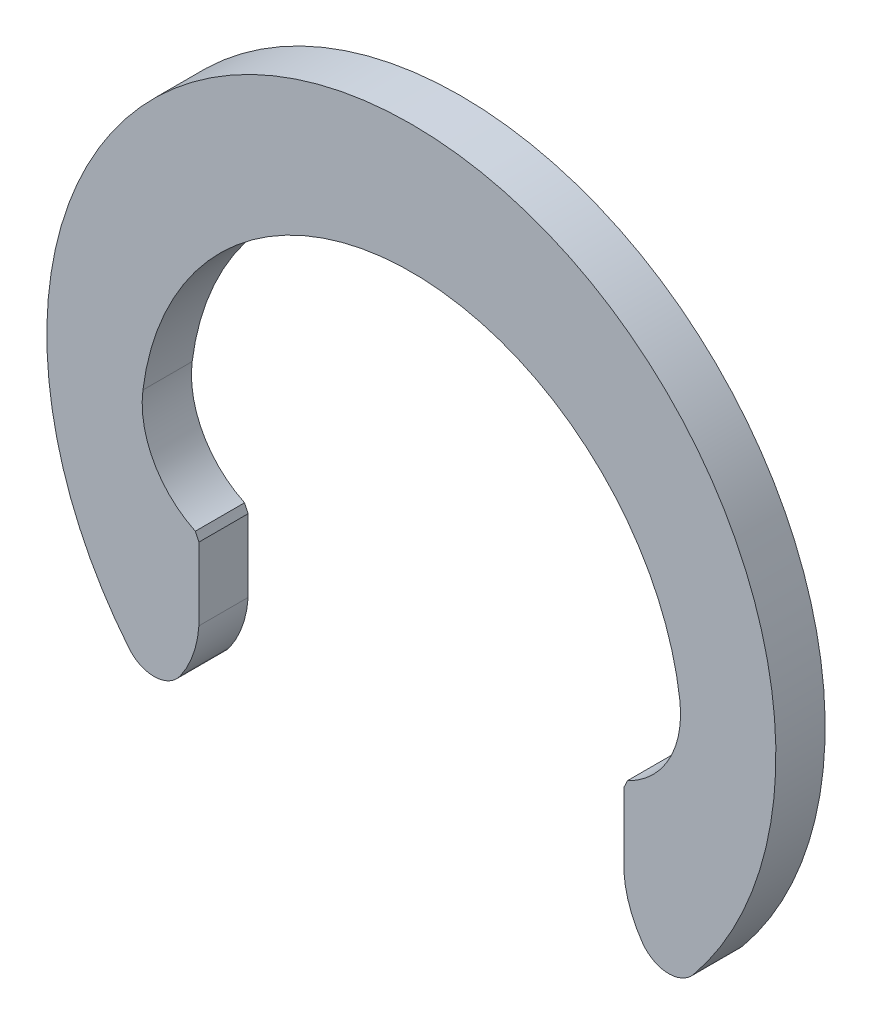
ISO-10303-21;
HEADER;
FILE_DESCRIPTION(('STEP AP214'),'2;1');
FILE_NAME('part.step','',(''),(''),'','','');
FILE_SCHEMA(('AUTOMOTIVE_DESIGN { 1 0 10303 214 1 1 1 1 }'));
ENDSEC;
DATA;
#1=APPLICATION_CONTEXT('core data for automotive mechanical design processes');
#2=APPLICATION_PROTOCOL_DEFINITION('international standard','automotive_design',2000,#1);
#3=PRODUCT_CONTEXT('',#1,'mechanical');
#4=PRODUCT('Part','Part','',(#3));
#5=PRODUCT_RELATED_PRODUCT_CATEGORY('part','',(#4));
#6=PRODUCT_DEFINITION_FORMATION('','',#4);
#7=PRODUCT_DEFINITION_CONTEXT('part definition',#1,'design');
#8=PRODUCT_DEFINITION('design','',#6,#7);
#9=PRODUCT_DEFINITION_SHAPE('','',#8);
#10=(LENGTH_UNIT() NAMED_UNIT(*) SI_UNIT(.MILLI.,.METRE.));
#11=(NAMED_UNIT(*) PLANE_ANGLE_UNIT() SI_UNIT($,.RADIAN.));
#12=(NAMED_UNIT(*) SI_UNIT($,.STERADIAN.) SOLID_ANGLE_UNIT());
#13=UNCERTAINTY_MEASURE_WITH_UNIT(LENGTH_MEASURE(1.E-05),#10,'distance_accuracy_value','');
#14=(GEOMETRIC_REPRESENTATION_CONTEXT(3) GLOBAL_UNCERTAINTY_ASSIGNED_CONTEXT((#13)) GLOBAL_UNIT_ASSIGNED_CONTEXT((#10,
#11,#12)) REPRESENTATION_CONTEXT('',''));
#15=CARTESIAN_POINT('',(0.,0.,0.));
#16=DIRECTION('',(0.,0.,1.));
#17=DIRECTION('',(1.,0.,0.));
#18=AXIS2_PLACEMENT_3D('',#15,#16,#17);
#19=CARTESIAN_POINT('',(0.,0.,-0.35));
#20=DIRECTION('',(0.,0.,1.));
#21=DIRECTION('',(1.,0.,0.));
#22=AXIS2_PLACEMENT_3D('',#19,#20,#21);
#23=PLANE('',#22);
#24=CARTESIAN_POINT('',(0.,0.,-0.35));
#25=DIRECTION('',(0.,0.,1.));
#26=DIRECTION('',(1.,0.,0.));
#27=AXIS2_PLACEMENT_3D('',#24,#25,#26);
#28=CIRCLE('',#27,3.7);
#29=CARTESIAN_POINT('',(2.86362795950369,-2.34299699307292,-0.35));
#30=VERTEX_POINT('',#29);
#31=CARTESIAN_POINT('',(-2.86362795950368,-2.34299699307293,-0.35));
#32=VERTEX_POINT('',#31);
#33=EDGE_CURVE('E140',#30,#32,#28,.T.);
#34=ORIENTED_EDGE('',*,*,#33,.F.);
#35=CARTESIAN_POINT('',(2.6120930711689,-2.13719320314084,-0.35));
#36=DIRECTION('',(0.,0.,-1.));
#37=DIRECTION('',(1.,0.,0.));
#38=AXIS2_PLACEMENT_3D('',#35,#36,#37);
#39=CIRCLE('',#38,0.325);
#40=CARTESIAN_POINT('',(2.34627823993633,-2.32418912688464,-0.35));
#41=VERTEX_POINT('',#40);
#42=EDGE_CURVE('E135',#30,#41,#39,.T.);
#43=ORIENTED_EDGE('',*,*,#42,.T.);
#44=CARTESIAN_POINT('',(3.20865351956933,-1.71752372269696,-0.35));
#45=DIRECTION('',(0.,0.,1.));
#46=DIRECTION('',(1.,0.,0.));
#47=AXIS2_PLACEMENT_3D('',#44,#45,#46);
#48=CIRCLE('',#47,1.05438799099777);
#49=CARTESIAN_POINT('',(2.15667568261897,-1.78877444989019,-0.35));
#50=VERTEX_POINT('',#49);
#51=EDGE_CURVE('E184',#50,#41,#48,.T.);
#52=ORIENTED_EDGE('',*,*,#51,.F.);
#53=DIRECTION('',(0.,-1.,0.));
#54=VECTOR('',#53,1.);
#55=CARTESIAN_POINT('',(2.15667568261898,-1.78877444989019,-0.35));
#56=LINE('',#55,#54);
#57=CARTESIAN_POINT('',(2.15667568261897,-1.05297198443263,-0.35));
#58=VERTEX_POINT('',#57);
#59=EDGE_CURVE('E10',#58,#50,#56,.T.);
#60=ORIENTED_EDGE('',*,*,#59,.F.);
#61=CARTESIAN_POINT('',(0.,0.,-0.35));
#62=DIRECTION('',(0.,0.,-1.));
#63=DIRECTION('',(-1.,0.,0.));
#64=AXIS2_PLACEMENT_3D('',#61,#62,#63);
#65=CIRCLE('',#64,2.4);
#66=CARTESIAN_POINT('',(2.19302872758202,-0.975,-0.35));
#67=VERTEX_POINT('',#66);
#68=EDGE_CURVE('E218',#67,#58,#65,.T.);
#69=ORIENTED_EDGE('',*,*,#68,.F.);
#70=CARTESIAN_POINT('',(1.78492705087858,-0.119710168645288,-0.35));
#71=DIRECTION('',(0.,0.,-1.));
#72=DIRECTION('',(-1.,0.,0.));
#73=AXIS2_PLACEMENT_3D('',#70,#71,#72);
#74=CIRCLE('',#73,0.947664325669659);
#75=CARTESIAN_POINT('',(2.725,0.,-0.35));
#76=VERTEX_POINT('',#75);
#77=EDGE_CURVE('E210',#76,#67,#74,.T.);
#78=ORIENTED_EDGE('',*,*,#77,.F.);
#79=CARTESIAN_POINT('',(0.,-0.347005208333333,-0.35));
#80=DIRECTION('',(0.,0.,-1.));
#81=DIRECTION('',(1.,0.,0.));
#82=AXIS2_PLACEMENT_3D('',#79,#80,#81);
#83=CIRCLE('',#82,2.74700520833333);
#84=CARTESIAN_POINT('',(-2.725,0.,-0.35));
#85=VERTEX_POINT('',#84);
#86=EDGE_CURVE('E166',#85,#76,#83,.T.);
#87=ORIENTED_EDGE('',*,*,#86,.F.);
#88=CARTESIAN_POINT('',(-1.78492705087858,-0.119710168645288,-0.35));
#89=DIRECTION('',(0.,0.,-1.));
#90=DIRECTION('',(1.,0.,0.));
#91=AXIS2_PLACEMENT_3D('',#88,#89,#90);
#92=CIRCLE('',#91,0.947664325669659);
#93=CARTESIAN_POINT('',(-2.19302872758202,-0.975,-0.35));
#94=VERTEX_POINT('',#93);
#95=EDGE_CURVE('E172',#94,#85,#92,.T.);
#96=ORIENTED_EDGE('',*,*,#95,.F.);
#97=CARTESIAN_POINT('',(0.,0.,-0.35));
#98=DIRECTION('',(0.,0.,-1.));
#99=DIRECTION('',(1.,0.,0.));
#100=AXIS2_PLACEMENT_3D('',#97,#98,#99);
#101=CIRCLE('',#100,2.4);
#102=CARTESIAN_POINT('',(-2.15667568261897,-1.05297198443263,-0.35));
#103=VERTEX_POINT('',#102);
#104=EDGE_CURVE('E171',#103,#94,#101,.T.);
#105=ORIENTED_EDGE('',*,*,#104,.F.);
#106=DIRECTION('',(0.,1.,0.));
#107=VECTOR('',#106,1.);
#108=CARTESIAN_POINT('',(-2.15667568261897,-1.42087321716141,-0.35));
#109=LINE('',#108,#107);
#110=CARTESIAN_POINT('',(-2.15667568261897,-1.78877444989019,-0.35));
#111=VERTEX_POINT('',#110);
#112=EDGE_CURVE('E253',#111,#103,#109,.T.);
#113=ORIENTED_EDGE('',*,*,#112,.F.);
#114=CARTESIAN_POINT('',(-3.20865351956933,-1.71752372269696,-0.35));
#115=DIRECTION('',(0.,0.,1.));
#116=DIRECTION('',(-1.,0.,0.));
#117=AXIS2_PLACEMENT_3D('',#114,#115,#116);
#118=CIRCLE('',#117,1.05438799099777);
#119=CARTESIAN_POINT('',(-2.34627823993633,-2.32418912688465,-0.35));
#120=VERTEX_POINT('',#119);
#121=EDGE_CURVE('E188',#120,#111,#118,.T.);
#122=ORIENTED_EDGE('',*,*,#121,.F.);
#123=CARTESIAN_POINT('',(-2.6120930711689,-2.13719320314084,-0.35));
#124=DIRECTION('',(0.,0.,-1.));
#125=DIRECTION('',(1.,0.,0.));
#126=AXIS2_PLACEMENT_3D('',#123,#124,#125);
#127=CIRCLE('',#126,0.325);
#128=EDGE_CURVE('E20',#120,#32,#127,.T.);
#129=ORIENTED_EDGE('',*,*,#128,.T.);
#130=EDGE_LOOP('',(#34,#43,#52,#60,#69,#78,#87,#96,#105,#113,#122,#129));
#131=FACE_BOUND('',#130,.T.);
#132=ADVANCED_FACE('F16',(#131),#23,.F.);
#133=CARTESIAN_POINT('',(2.15667568261898,-1.78877444989019,0.35));
#134=DIRECTION('',(1.,0.,0.));
#135=DIRECTION('',(0.,1.,0.));
#136=AXIS2_PLACEMENT_3D('',#133,#134,#135);
#137=PLANE('',#136);
#138=DIRECTION('',(0.,1.,0.));
#139=VECTOR('',#138,1.);
#140=CARTESIAN_POINT('',(2.15667568261897,-0.894387224945091,0.15));
#141=LINE('',#140,#139);
#142=CARTESIAN_POINT('',(2.15667568261897,-1.78877444989019,0.15));
#143=VERTEX_POINT('',#142);
#144=CARTESIAN_POINT('',(2.15667568261897,-1.05297198443263,0.15));
#145=VERTEX_POINT('',#144);
#146=EDGE_CURVE('E197',#143,#145,#141,.T.);
#147=ORIENTED_EDGE('',*,*,#146,.T.);
#148=DIRECTION('',(0.,0.,-1.));
#149=VECTOR('',#148,1.);
#150=CARTESIAN_POINT('',(2.15667568261897,-1.05297198443263,0.35));
#151=LINE('',#150,#149);
#152=EDGE_CURVE('E27',#145,#58,#151,.T.);
#153=ORIENTED_EDGE('',*,*,#152,.T.);
#154=ORIENTED_EDGE('',*,*,#59,.T.);
#155=DIRECTION('',(0.,0.,-1.));
#156=VECTOR('',#155,1.);
#157=CARTESIAN_POINT('',(2.15667568261897,-1.78877444989019,0.35));
#158=LINE('',#157,#156);
#159=EDGE_CURVE('E205',#143,#50,#158,.T.);
#160=ORIENTED_EDGE('',*,*,#159,.F.);
#161=EDGE_LOOP('',(#147,#153,#154,#160));
#162=FACE_BOUND('',#161,.T.);
#163=ADVANCED_FACE('F381',(#162),#137,.F.);
#164=CARTESIAN_POINT('',(0.,0.,0.35));
#165=DIRECTION('',(0.,0.,-1.));
#166=DIRECTION('',(-1.,0.,0.));
#167=AXIS2_PLACEMENT_3D('',#164,#165,#166);
#168=CYLINDRICAL_SURFACE('',#167,2.4);
#169=CARTESIAN_POINT('',(0.,0.,0.15));
#170=DIRECTION('',(0.,0.,1.));
#171=DIRECTION('',(-1.,0.,0.));
#172=AXIS2_PLACEMENT_3D('',#169,#170,#171);
#173=CIRCLE('',#172,2.4);
#174=CARTESIAN_POINT('',(2.19302872758202,-0.975,0.15));
#175=VERTEX_POINT('',#174);
#176=EDGE_CURVE('E202',#145,#175,#173,.T.);
#177=ORIENTED_EDGE('',*,*,#176,.T.);
#178=DIRECTION('',(0.,0.,-1.));
#179=VECTOR('',#178,1.);
#180=CARTESIAN_POINT('',(2.19302872758202,-0.975,0.35));
#181=LINE('',#180,#179);
#182=EDGE_CURVE('E214',#175,#67,#181,.T.);
#183=ORIENTED_EDGE('',*,*,#182,.T.);
#184=ORIENTED_EDGE('',*,*,#68,.T.);
#185=ORIENTED_EDGE('',*,*,#152,.F.);
#186=EDGE_LOOP('',(#177,#183,#184,#185));
#187=FACE_BOUND('',#186,.T.);
#188=ADVANCED_FACE('F327',(#187),#168,.F.);
#189=CARTESIAN_POINT('',(1.78492705087858,-0.119710168645288,0.35));
#190=DIRECTION('',(0.,0.,-1.));
#191=DIRECTION('',(0.87783762329979,-0.478958356351965,0.));
#192=AXIS2_PLACEMENT_3D('',#189,#190,#191);
#193=CYLINDRICAL_SURFACE('',#192,0.947664325669659);
#194=CARTESIAN_POINT('',(1.78492705087858,-0.119710168645288,0.15));
#195=DIRECTION('',(0.,0.,1.));
#196=DIRECTION('',(-1.,0.,0.));
#197=AXIS2_PLACEMENT_3D('',#194,#195,#196);
#198=CIRCLE('',#197,0.947664325669659);
#199=CARTESIAN_POINT('',(2.725,0.,0.15));
#200=VERTEX_POINT('',#199);
#201=EDGE_CURVE('E232',#175,#200,#198,.T.);
#202=ORIENTED_EDGE('',*,*,#201,.T.);
#203=DIRECTION('',(0.,0.,-1.));
#204=VECTOR('',#203,1.);
#205=CARTESIAN_POINT('',(2.725,0.,0.35));
#206=LINE('',#205,#204);
#207=EDGE_CURVE('E170',#200,#76,#206,.T.);
#208=ORIENTED_EDGE('',*,*,#207,.T.);
#209=ORIENTED_EDGE('',*,*,#77,.T.);
#210=ORIENTED_EDGE('',*,*,#182,.F.);
#211=EDGE_LOOP('',(#202,#208,#209,#210));
#212=FACE_BOUND('',#211,.T.);
#213=ADVANCED_FACE('F322',(#212),#193,.F.);
#214=CARTESIAN_POINT('',(0.,-0.347005208333333,0.35));
#215=DIRECTION('',(0.,0.,-1.));
#216=DIRECTION('',(-1.,0.,0.));
#217=AXIS2_PLACEMENT_3D('',#214,#215,#216);
#218=CYLINDRICAL_SURFACE('',#217,2.74700520833333);
#219=CARTESIAN_POINT('',(0.,-0.347005208333333,0.15));
#220=DIRECTION('',(0.,0.,1.));
#221=DIRECTION('',(-1.,0.,0.));
#222=AXIS2_PLACEMENT_3D('',#219,#220,#221);
#223=CIRCLE('',#222,2.74700520833333);
#224=CARTESIAN_POINT('',(-2.725,0.,0.15));
#225=VERTEX_POINT('',#224);
#226=EDGE_CURVE('E228',#200,#225,#223,.T.);
#227=ORIENTED_EDGE('',*,*,#226,.T.);
#228=DIRECTION('',(0.,0.,-1.));
#229=VECTOR('',#228,1.);
#230=CARTESIAN_POINT('',(-2.725,0.,0.35));
#231=LINE('',#230,#229);
#232=EDGE_CURVE('E176',#225,#85,#231,.T.);
#233=ORIENTED_EDGE('',*,*,#232,.T.);
#234=ORIENTED_EDGE('',*,*,#86,.T.);
#235=ORIENTED_EDGE('',*,*,#207,.F.);
#236=EDGE_LOOP('',(#227,#233,#234,#235));
#237=FACE_BOUND('',#236,.T.);
#238=ADVANCED_FACE('F314',(#237),#218,.F.);
#239=CARTESIAN_POINT('',(0.,0.,0.35));
#240=DIRECTION('',(0.,0.,-1.));
#241=DIRECTION('',(-1.,0.,0.));
#242=AXIS2_PLACEMENT_3D('',#239,#240,#241);
#243=CYLINDRICAL_SURFACE('',#242,2.4);
#244=CARTESIAN_POINT('',(0.,0.,0.15));
#245=DIRECTION('',(0.,0.,1.));
#246=DIRECTION('',(-1.,0.,0.));
#247=AXIS2_PLACEMENT_3D('',#244,#245,#246);
#248=CIRCLE('',#247,2.4);
#249=CARTESIAN_POINT('',(-2.19302872758202,-0.975,0.15));
#250=VERTEX_POINT('',#249);
#251=CARTESIAN_POINT('',(-2.15667568261897,-1.05297198443263,0.15));
#252=VERTEX_POINT('',#251);
#253=EDGE_CURVE('E191',#250,#252,#248,.T.);
#254=ORIENTED_EDGE('',*,*,#253,.T.);
#255=DIRECTION('',(0.,0.,-1.));
#256=VECTOR('',#255,1.);
#257=CARTESIAN_POINT('',(-2.15667568261897,-1.05297198443263,0.35));
#258=LINE('',#257,#256);
#259=EDGE_CURVE('E189',#252,#103,#258,.T.);
#260=ORIENTED_EDGE('',*,*,#259,.T.);
#261=ORIENTED_EDGE('',*,*,#104,.T.);
#262=DIRECTION('',(0.,0.,-1.));
#263=VECTOR('',#262,1.);
#264=CARTESIAN_POINT('',(-2.19302872758202,-0.975,0.35));
#265=LINE('',#264,#263);
#266=EDGE_CURVE('E177',#250,#94,#265,.T.);
#267=ORIENTED_EDGE('',*,*,#266,.F.);
#268=EDGE_LOOP('',(#254,#260,#261,#267));
#269=FACE_BOUND('',#268,.T.);
#270=ADVANCED_FACE('F18',(#269),#243,.F.);
#271=CARTESIAN_POINT('',(-1.78492705087858,-0.119710168645288,0.35));
#272=DIRECTION('',(0.,0.,-1.));
#273=DIRECTION('',(-1.,0.,0.));
#274=AXIS2_PLACEMENT_3D('',#271,#272,#273);
#275=CYLINDRICAL_SURFACE('',#274,0.947664325669659);
#276=CARTESIAN_POINT('',(-1.78492705087858,-0.119710168645288,0.15));
#277=DIRECTION('',(0.,0.,1.));
#278=DIRECTION('',(-1.,0.,0.));
#279=AXIS2_PLACEMENT_3D('',#276,#277,#278);
#280=CIRCLE('',#279,0.947664325669659);
#281=EDGE_CURVE('E195',#225,#250,#280,.T.);
#282=ORIENTED_EDGE('',*,*,#281,.T.);
#283=ORIENTED_EDGE('',*,*,#266,.T.);
#284=ORIENTED_EDGE('',*,*,#95,.T.);
#285=ORIENTED_EDGE('',*,*,#232,.F.);
#286=EDGE_LOOP('',(#282,#283,#284,#285));
#287=FACE_BOUND('',#286,.T.);
#288=ADVANCED_FACE('F313',(#287),#275,.F.);
#289=CARTESIAN_POINT('',(3.20865351956933,-1.71752372269696,0.35));
#290=DIRECTION('',(0.,0.,-1.));
#291=DIRECTION('',(-1.,0.,0.));
#292=AXIS2_PLACEMENT_3D('',#289,#290,#291);
#293=CYLINDRICAL_SURFACE('',#292,1.05438799099777);
#294=CARTESIAN_POINT('',(3.20865351956933,-1.71752372269696,0.15));
#295=DIRECTION('',(0.,0.,-1.));
#296=DIRECTION('',(-1.,0.,0.));
#297=AXIS2_PLACEMENT_3D('',#294,#295,#296);
#298=CIRCLE('',#297,1.05438799099777);
#299=CARTESIAN_POINT('',(2.34627823993633,-2.32418912688464,0.15));
#300=VERTEX_POINT('',#299);
#301=EDGE_CURVE('E156',#300,#143,#298,.T.);
#302=ORIENTED_EDGE('',*,*,#301,.T.);
#303=ORIENTED_EDGE('',*,*,#159,.T.);
#304=ORIENTED_EDGE('',*,*,#51,.T.);
#305=DIRECTION('',(0.,0.,1.));
#306=VECTOR('',#305,1.);
#307=CARTESIAN_POINT('',(2.34627823993633,-2.32418912688464,0.35));
#308=LINE('',#307,#306);
#309=EDGE_CURVE('E180',#41,#300,#308,.T.);
#310=ORIENTED_EDGE('',*,*,#309,.T.);
#311=EDGE_LOOP('',(#302,#303,#304,#310));
#312=FACE_BOUND('',#311,.T.);
#313=ADVANCED_FACE('F258',(#312),#293,.T.);
#314=CARTESIAN_POINT('',(2.6120930711689,-2.13719320314084,0.35));
#315=DIRECTION('',(0.,0.,-1.));
#316=DIRECTION('',(-1.,0.,0.));
#317=AXIS2_PLACEMENT_3D('',#314,#315,#316);
#318=CYLINDRICAL_SURFACE('',#317,0.325);
#319=CARTESIAN_POINT('',(2.6120930711689,-2.13719320314084,0.15));
#320=DIRECTION('',(0.,0.,-1.));
#321=DIRECTION('',(-1.,0.,0.));
#322=AXIS2_PLACEMENT_3D('',#319,#320,#321);
#323=CIRCLE('',#322,0.325);
#324=CARTESIAN_POINT('',(2.86362795950369,-2.34299699307292,0.15));
#325=VERTEX_POINT('',#324);
#326=EDGE_CURVE('E132',#325,#300,#323,.T.);
#327=ORIENTED_EDGE('',*,*,#326,.T.);
#328=ORIENTED_EDGE('',*,*,#309,.F.);
#329=ORIENTED_EDGE('',*,*,#42,.F.);
#330=DIRECTION('',(0.,0.,-1.));
#331=VECTOR('',#330,1.);
#332=CARTESIAN_POINT('',(2.86362795950369,-2.34299699307292,0.35));
#333=LINE('',#332,#331);
#334=EDGE_CURVE('E127',#325,#30,#333,.T.);
#335=ORIENTED_EDGE('',*,*,#334,.F.);
#336=EDGE_LOOP('',(#327,#328,#329,#335));
#337=FACE_BOUND('',#336,.T.);
#338=ADVANCED_FACE('F129',(#337),#318,.T.);
#339=CARTESIAN_POINT('',(0.,0.,0.35));
#340=DIRECTION('',(0.,0.,-1.));
#341=DIRECTION('',(0.,1.,0.));
#342=AXIS2_PLACEMENT_3D('',#339,#340,#341);
#343=CYLINDRICAL_SURFACE('',#342,3.7);
#344=CARTESIAN_POINT('',(0.,0.,0.15));
#345=DIRECTION('',(0.,0.,-1.));
#346=DIRECTION('',(-1.,0.,0.));
#347=AXIS2_PLACEMENT_3D('',#344,#345,#346);
#348=CIRCLE('',#347,3.7);
#349=CARTESIAN_POINT('',(-2.86362795950368,-2.34299699307293,0.15));
#350=VERTEX_POINT('',#349);
#351=EDGE_CURVE('E143',#350,#325,#348,.T.);
#352=ORIENTED_EDGE('',*,*,#351,.T.);
#353=ORIENTED_EDGE('',*,*,#334,.T.);
#354=ORIENTED_EDGE('',*,*,#33,.T.);
#355=DIRECTION('',(0.,0.,1.));
#356=VECTOR('',#355,1.);
#357=CARTESIAN_POINT('',(-2.86362795950368,-2.34299699307293,0.35));
#358=LINE('',#357,#356);
#359=EDGE_CURVE('E146',#32,#350,#358,.T.);
#360=ORIENTED_EDGE('',*,*,#359,.T.);
#361=EDGE_LOOP('',(#352,#353,#354,#360));
#362=FACE_BOUND('',#361,.T.);
#363=ADVANCED_FACE('F144',(#362),#343,.T.);
#364=CARTESIAN_POINT('',(-2.6120930711689,-2.13719320314084,0.35));
#365=DIRECTION('',(0.,0.,-1.));
#366=DIRECTION('',(-1.,0.,0.));
#367=AXIS2_PLACEMENT_3D('',#364,#365,#366);
#368=CYLINDRICAL_SURFACE('',#367,0.325);
#369=CARTESIAN_POINT('',(-2.6120930711689,-2.13719320314084,0.15));
#370=DIRECTION('',(0.,0.,-1.));
#371=DIRECTION('',(-1.,0.,0.));
#372=AXIS2_PLACEMENT_3D('',#369,#370,#371);
#373=CIRCLE('',#372,0.325);
#374=CARTESIAN_POINT('',(-2.34627823993633,-2.32418912688465,0.15));
#375=VERTEX_POINT('',#374);
#376=EDGE_CURVE('E151',#375,#350,#373,.T.);
#377=ORIENTED_EDGE('',*,*,#376,.T.);
#378=ORIENTED_EDGE('',*,*,#359,.F.);
#379=ORIENTED_EDGE('',*,*,#128,.F.);
#380=DIRECTION('',(0.,0.,-1.));
#381=VECTOR('',#380,1.);
#382=CARTESIAN_POINT('',(-2.34627823993633,-2.32418912688465,0.35));
#383=LINE('',#382,#381);
#384=EDGE_CURVE('E185',#375,#120,#383,.T.);
#385=ORIENTED_EDGE('',*,*,#384,.F.);
#386=EDGE_LOOP('',(#377,#378,#379,#385));
#387=FACE_BOUND('',#386,.T.);
#388=ADVANCED_FACE('F336',(#387),#368,.T.);
#389=CARTESIAN_POINT('',(-3.20865351956933,-1.71752372269696,0.35));
#390=DIRECTION('',(0.,0.,-1.));
#391=DIRECTION('',(-1.,0.,0.));
#392=AXIS2_PLACEMENT_3D('',#389,#390,#391);
#393=CYLINDRICAL_SURFACE('',#392,1.05438799099777);
#394=CARTESIAN_POINT('',(-3.20865351956933,-1.71752372269696,0.15));
#395=DIRECTION('',(0.,0.,-1.));
#396=DIRECTION('',(-1.,0.,0.));
#397=AXIS2_PLACEMENT_3D('',#394,#395,#396);
#398=CIRCLE('',#397,1.05438799099777);
#399=CARTESIAN_POINT('',(-2.15667568261897,-1.78877444989019,0.15));
#400=VERTEX_POINT('',#399);
#401=EDGE_CURVE('E206',#400,#375,#398,.T.);
#402=ORIENTED_EDGE('',*,*,#401,.T.);
#403=ORIENTED_EDGE('',*,*,#384,.T.);
#404=ORIENTED_EDGE('',*,*,#121,.T.);
#405=DIRECTION('',(0.,0.,-1.));
#406=VECTOR('',#405,1.);
#407=CARTESIAN_POINT('',(-2.15667568261897,-1.78877444989019,0.35));
#408=LINE('',#407,#406);
#409=EDGE_CURVE('E201',#400,#111,#408,.T.);
#410=ORIENTED_EDGE('',*,*,#409,.F.);
#411=EDGE_LOOP('',(#402,#403,#404,#410));
#412=FACE_BOUND('',#411,.T.);
#413=ADVANCED_FACE('F355',(#412),#393,.T.);
#414=CARTESIAN_POINT('',(-2.15667568261897,-1.42087321716141,0.35));
#415=DIRECTION('',(-1.,0.,0.));
#416=DIRECTION('',(0.,0.,1.));
#417=AXIS2_PLACEMENT_3D('',#414,#415,#416);
#418=PLANE('',#417);
#419=DIRECTION('',(0.,-1.,0.));
#420=VECTOR('',#419,1.);
#421=CARTESIAN_POINT('',(-2.15667568261897,-0.710436608580704,0.15));
#422=LINE('',#421,#420);
#423=EDGE_CURVE('E196',#252,#400,#422,.T.);
#424=ORIENTED_EDGE('',*,*,#423,.T.);
#425=ORIENTED_EDGE('',*,*,#409,.T.);
#426=ORIENTED_EDGE('',*,*,#112,.T.);
#427=ORIENTED_EDGE('',*,*,#259,.F.);
#428=EDGE_LOOP('',(#424,#425,#426,#427));
#429=FACE_BOUND('',#428,.T.);
#430=ADVANCED_FACE('F350',(#429),#418,.F.);
#431=CARTESIAN_POINT('',(0.,0.,0.15));
#432=DIRECTION('',(0.,0.,1.));
#433=DIRECTION('',(1.,0.,0.));
#434=AXIS2_PLACEMENT_3D('',#431,#432,#433);
#435=PLANE('',#434);
#436=ORIENTED_EDGE('',*,*,#301,.F.);
#437=ORIENTED_EDGE('',*,*,#326,.F.);
#438=ORIENTED_EDGE('',*,*,#351,.F.);
#439=ORIENTED_EDGE('',*,*,#376,.F.);
#440=ORIENTED_EDGE('',*,*,#401,.F.);
#441=ORIENTED_EDGE('',*,*,#423,.F.);
#442=ORIENTED_EDGE('',*,*,#253,.F.);
#443=ORIENTED_EDGE('',*,*,#281,.F.);
#444=ORIENTED_EDGE('',*,*,#226,.F.);
#445=ORIENTED_EDGE('',*,*,#201,.F.);
#446=ORIENTED_EDGE('',*,*,#176,.F.);
#447=ORIENTED_EDGE('',*,*,#146,.F.);
#448=EDGE_LOOP('',(#436,#437,#438,#439,#440,#441,#442,#443,#444,#445,#446,#447));
#449=FACE_BOUND('',#448,.T.);
#450=ADVANCED_FACE('F153',(#449),#435,.T.);
#451=CLOSED_SHELL('',(#132,#163,#188,#213,#238,#270,#288,#313,#338,#363,#388,#413,#430,#450));
#452=MANIFOLD_SOLID_BREP('B1',#451);
#453=ADVANCED_BREP_SHAPE_REPRESENTATION('',(#18,#452),#14);
#454=SHAPE_DEFINITION_REPRESENTATION(#9,#453);
ENDSEC;
END-ISO-10303-21;
